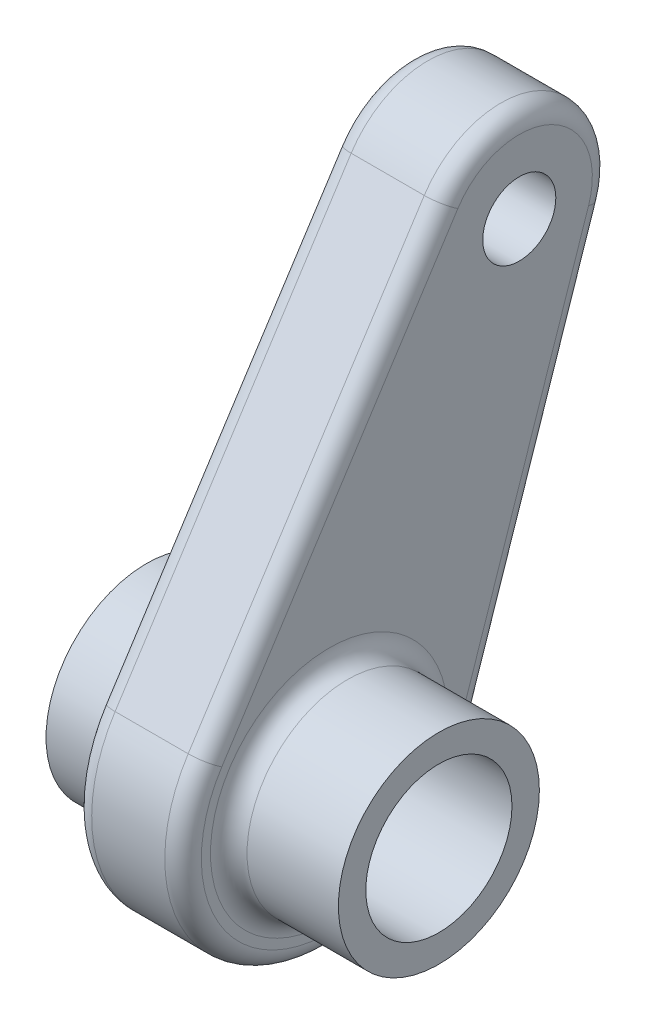
ISO-10303-21;
HEADER;
FILE_DESCRIPTION(('STEP AP214'),'2;1');
FILE_NAME('part.step','',(''),(''),'','','');
FILE_SCHEMA(('AUTOMOTIVE_DESIGN { 1 0 10303 214 1 1 1 1 }'));
ENDSEC;
DATA;
#1=APPLICATION_CONTEXT('core data for automotive mechanical design processes');
#2=APPLICATION_PROTOCOL_DEFINITION('international standard','automotive_design',2000,#1);
#3=PRODUCT_CONTEXT('',#1,'mechanical');
#4=PRODUCT('Part','Part','',(#3));
#5=PRODUCT_RELATED_PRODUCT_CATEGORY('part','',(#4));
#6=PRODUCT_DEFINITION_FORMATION('','',#4);
#7=PRODUCT_DEFINITION_CONTEXT('part definition',#1,'design');
#8=PRODUCT_DEFINITION('design','',#6,#7);
#9=PRODUCT_DEFINITION_SHAPE('','',#8);
#10=(LENGTH_UNIT() NAMED_UNIT(*) SI_UNIT(.MILLI.,.METRE.));
#11=(NAMED_UNIT(*) PLANE_ANGLE_UNIT() SI_UNIT($,.RADIAN.));
#12=(NAMED_UNIT(*) SI_UNIT($,.STERADIAN.) SOLID_ANGLE_UNIT());
#13=UNCERTAINTY_MEASURE_WITH_UNIT(LENGTH_MEASURE(1.E-05),#10,'distance_accuracy_value','');
#14=(GEOMETRIC_REPRESENTATION_CONTEXT(3) GLOBAL_UNCERTAINTY_ASSIGNED_CONTEXT((#13)) GLOBAL_UNIT_ASSIGNED_CONTEXT((#10,
#11,#12)) REPRESENTATION_CONTEXT('',''));
#15=CARTESIAN_POINT('',(0.,0.,0.));
#16=DIRECTION('',(0.,0.,1.));
#17=DIRECTION('',(1.,0.,0.));
#18=AXIS2_PLACEMENT_3D('',#15,#16,#17);
#19=CARTESIAN_POINT('',(19.05,0.,0.));
#20=DIRECTION('',(1.,0.,0.));
#21=DIRECTION('',(0.,0.,-1.));
#22=AXIS2_PLACEMENT_3D('',#19,#20,#21);
#23=PLANE('',#22);
#24=CARTESIAN_POINT('',(19.05,0.,0.));
#25=DIRECTION('',(1.,0.,0.));
#26=DIRECTION('',(0.,0.,-1.));
#27=AXIS2_PLACEMENT_3D('',#24,#25,#26);
#28=CIRCLE('',#27,20.6375);
#29=CARTESIAN_POINT('',(19.05,0.,-20.6375));
#30=VERTEX_POINT('',#29);
#31=EDGE_CURVE('E185',#30,#30,#28,.F.);
#32=ORIENTED_EDGE('',*,*,#31,.T.);
#33=EDGE_LOOP('',(#32));
#34=FACE_BOUND('',#33,.T.);
#35=CARTESIAN_POINT('',(19.05,68.675701226411,-33.0164816578135));
#36=DIRECTION('',(1.,0.,0.));
#37=DIRECTION('',(0.,0.,-1.));
#38=AXIS2_PLACEMENT_3D('',#35,#36,#37);
#39=CIRCLE('',#38,12.6999999999999);
#40=CARTESIAN_POINT('',(19.05,64.646857524905,-45.0605016855631));
#41=VERTEX_POINT('',#40);
#42=CARTESIAN_POINT('',(19.05,75.5660324790174,-22.3481483658061));
#43=VERTEX_POINT('',#42);
#44=EDGE_CURVE('E61',#41,#43,#39,.T.);
#45=ORIENTED_EDGE('',*,*,#44,.T.);
#46=DIRECTION('',(0.,0.840026243465153,-0.54254576792177));
#47=VECTOR('',#46,1.);
#48=CARTESIAN_POINT('',(19.05,12.0580796920614,18.669583261013));
#49=LINE('',#48,#47);
#50=CARTESIAN_POINT('',(19.05,12.0580796920613,18.669583261013));
#51=VERTEX_POINT('',#50);
#52=EDGE_CURVE('E182',#43,#51,#49,.F.);
#53=ORIENTED_EDGE('',*,*,#52,.T.);
#54=CARTESIAN_POINT('',(19.05,0.,0.));
#55=DIRECTION('',(1.,0.,0.));
#56=DIRECTION('',(0.,0.,-1.));
#57=AXIS2_PLACEMENT_3D('',#54,#55,#56);
#58=CIRCLE('',#57,22.225);
#59=CARTESIAN_POINT('',(19.05,-7.05047647763552,-21.0770350485619));
#60=VERTEX_POINT('',#59);
#61=EDGE_CURVE('E175',#51,#60,#58,.T.);
#62=ORIENTED_EDGE('',*,*,#61,.T.);
#63=DIRECTION('',(0.,-0.948348033681077,0.317231787520159));
#64=VECTOR('',#63,1.);
#65=CARTESIAN_POINT('',(19.05,-7.05047647763551,-21.0770350485619));
#66=LINE('',#65,#64);
#67=EDGE_CURVE('E66',#60,#41,#66,.F.);
#68=ORIENTED_EDGE('',*,*,#67,.T.);
#69=EDGE_LOOP('',(#45,#53,#62,#68));
#70=FACE_BOUND('',#69,.T.);
#71=CARTESIAN_POINT('',(19.05,68.675701226411,-33.0164816578135));
#72=DIRECTION('',(1.,0.,0.));
#73=DIRECTION('',(0.,0.,-1.));
#74=AXIS2_PLACEMENT_3D('',#71,#72,#73);
#75=CIRCLE('',#74,6.34999999999995);
#76=CARTESIAN_POINT('',(19.05,68.675701226411,-39.3664816578134));
#77=VERTEX_POINT('',#76);
#78=EDGE_CURVE('E239',#77,#77,#75,.T.);
#79=ORIENTED_EDGE('',*,*,#78,.F.);
#80=EDGE_LOOP('',(#79));
#81=FACE_BOUND('',#80,.T.);
#82=ADVANCED_FACE('F43',(#34,#70,#81),#23,.T.);
#83=CARTESIAN_POINT('',(-12.7,0.,0.));
#84=DIRECTION('',(1.,0.,0.));
#85=DIRECTION('',(0.,0.,-1.));
#86=AXIS2_PLACEMENT_3D('',#83,#84,#85);
#87=CYLINDRICAL_SURFACE('',#86,17.4625);
#88=CARTESIAN_POINT('',(-3.175,0.,0.));
#89=DIRECTION('',(1.,0.,0.));
#90=DIRECTION('',(0.,0.,-1.));
#91=AXIS2_PLACEMENT_3D('',#88,#89,#90);
#92=CIRCLE('',#91,17.4625);
#93=CARTESIAN_POINT('',(-3.175,0.,-17.4625));
#94=VERTEX_POINT('',#93);
#95=EDGE_CURVE('E193',#94,#94,#92,.F.);
#96=ORIENTED_EDGE('',*,*,#95,.T.);
#97=EDGE_LOOP('',(#96));
#98=FACE_BOUND('',#97,.T.);
#99=CARTESIAN_POINT('',(-12.7,0.,0.));
#100=DIRECTION('',(1.,0.,0.));
#101=DIRECTION('',(0.,0.,-1.));
#102=AXIS2_PLACEMENT_3D('',#99,#100,#101);
#103=CIRCLE('',#102,17.4625);
#104=CARTESIAN_POINT('',(-12.7,0.,-17.4625));
#105=VERTEX_POINT('',#104);
#106=EDGE_CURVE('E143',#105,#105,#103,.T.);
#107=ORIENTED_EDGE('',*,*,#106,.T.);
#108=EDGE_LOOP('',(#107));
#109=FACE_BOUND('',#108,.T.);
#110=ADVANCED_FACE('F234',(#98,#109),#87,.T.);
#111=CARTESIAN_POINT('',(-12.7,0.,0.));
#112=DIRECTION('',(1.,0.,0.));
#113=DIRECTION('',(0.,0.,-1.));
#114=AXIS2_PLACEMENT_3D('',#111,#112,#113);
#115=CYLINDRICAL_SURFACE('',#114,12.7);
#116=CARTESIAN_POINT('',(38.1,0.,0.));
#117=DIRECTION('',(1.,0.,0.));
#118=DIRECTION('',(0.,0.,-1.));
#119=AXIS2_PLACEMENT_3D('',#116,#117,#118);
#120=CIRCLE('',#119,12.7);
#121=CARTESIAN_POINT('',(38.1,0.,-12.7));
#122=VERTEX_POINT('',#121);
#123=EDGE_CURVE('E251',#122,#122,#120,.T.);
#124=ORIENTED_EDGE('',*,*,#123,.T.);
#125=EDGE_LOOP('',(#124));
#126=FACE_BOUND('',#125,.T.);
#127=CARTESIAN_POINT('',(-12.7,0.,0.));
#128=DIRECTION('',(1.,0.,0.));
#129=DIRECTION('',(0.,0.,-1.));
#130=AXIS2_PLACEMENT_3D('',#127,#128,#129);
#131=CIRCLE('',#130,12.7);
#132=CARTESIAN_POINT('',(-12.7,0.,-12.7));
#133=VERTEX_POINT('',#132);
#134=EDGE_CURVE('E139',#133,#133,#131,.T.);
#135=ORIENTED_EDGE('',*,*,#134,.F.);
#136=EDGE_LOOP('',(#135));
#137=FACE_BOUND('',#136,.T.);
#138=ADVANCED_FACE('F275',(#126,#137),#115,.F.);
#139=CARTESIAN_POINT('',(-12.7,0.,0.));
#140=DIRECTION('',(1.,0.,0.));
#141=DIRECTION('',(0.,0.,-1.));
#142=AXIS2_PLACEMENT_3D('',#139,#140,#141);
#143=PLANE('',#142);
#144=ORIENTED_EDGE('',*,*,#106,.F.);
#145=EDGE_LOOP('',(#144));
#146=FACE_BOUND('',#145,.T.);
#147=ORIENTED_EDGE('',*,*,#134,.T.);
#148=EDGE_LOOP('',(#147));
#149=FACE_BOUND('',#148,.T.);
#150=ADVANCED_FACE('F271',(#146,#149),#143,.F.);
#151=CARTESIAN_POINT('',(19.05,-8.05768740301202,-24.0880400554993));
#152=DIRECTION('',(0.,-0.317231787520159,-0.948348033681077));
#153=DIRECTION('',(0.,0.948348033681077,-0.317231787520159));
#154=AXIS2_PLACEMENT_3D('',#151,#152,#153);
#155=PLANE('',#154);
#156=DIRECTION('',(-1.,0.,0.));
#157=VECTOR('',#156,1.);
#158=CARTESIAN_POINT('',(19.05,-8.05768740301201,-24.0880400554993));
#159=LINE('',#158,#157);
#160=CARTESIAN_POINT('',(15.875,-8.05768740301201,-24.0880400554993));
#161=VERTEX_POINT('',#160);
#162=CARTESIAN_POINT('',(3.17500000000001,-8.05768740301201,-24.0880400554993));
#163=VERTEX_POINT('',#162);
#164=EDGE_CURVE('E242',#161,#163,#159,.T.);
#165=ORIENTED_EDGE('',*,*,#164,.T.);
#166=DIRECTION('',(0.,-0.948348033681077,0.317231787520159));
#167=VECTOR('',#166,1.);
#168=CARTESIAN_POINT('',(3.175,63.6396465995285,-48.0715066925005));
#169=LINE('',#168,#167);
#170=CARTESIAN_POINT('',(3.17500000000001,63.6396465995285,-48.0715066925005));
#171=VERTEX_POINT('',#170);
#172=EDGE_CURVE('E128',#163,#171,#169,.F.);
#173=ORIENTED_EDGE('',*,*,#172,.T.);
#174=DIRECTION('',(-1.,0.,0.));
#175=VECTOR('',#174,1.);
#176=CARTESIAN_POINT('',(19.05,63.6396465995285,-48.0715066925005));
#177=LINE('',#176,#175);
#178=CARTESIAN_POINT('',(15.875,63.6396465995285,-48.0715066925005));
#179=VERTEX_POINT('',#178);
#180=EDGE_CURVE('E263',#179,#171,#177,.T.);
#181=ORIENTED_EDGE('',*,*,#180,.F.);
#182=DIRECTION('',(0.,-0.948348033681077,0.317231787520159));
#183=VECTOR('',#182,1.);
#184=CARTESIAN_POINT('',(15.875,-8.05768740301202,-24.0880400554993));
#185=LINE('',#184,#183);
#186=EDGE_CURVE('E170',#179,#161,#185,.T.);
#187=ORIENTED_EDGE('',*,*,#186,.T.);
#188=EDGE_LOOP('',(#165,#173,#181,#187));
#189=FACE_BOUND('',#188,.T.);
#190=ADVANCED_FACE('F274',(#189),#155,.T.);
#191=CARTESIAN_POINT('',(19.05,68.675701226411,-33.0164816578135));
#192=DIRECTION('',(-1.,0.,0.));
#193=DIRECTION('',(0.,0.,1.));
#194=AXIS2_PLACEMENT_3D('',#191,#192,#193);
#195=CYLINDRICAL_SURFACE('',#194,15.8749999999999);
#196=ORIENTED_EDGE('',*,*,#180,.T.);
#197=CARTESIAN_POINT('',(3.175,68.675701226411,-33.0164816578135));
#198=DIRECTION('',(1.,0.,0.));
#199=DIRECTION('',(0.,0.,-1.));
#200=AXIS2_PLACEMENT_3D('',#197,#198,#199);
#201=CIRCLE('',#200,15.8749999999999);
#202=CARTESIAN_POINT('',(3.17500000000001,77.2886152921691,-19.6810650428042));
#203=VERTEX_POINT('',#202);
#204=EDGE_CURVE('E167',#171,#203,#201,.T.);
#205=ORIENTED_EDGE('',*,*,#204,.T.);
#206=DIRECTION('',(-1.,0.,0.));
#207=VECTOR('',#206,1.);
#208=CARTESIAN_POINT('',(19.05,77.2886152921691,-19.6810650428042));
#209=LINE('',#208,#207);
#210=CARTESIAN_POINT('',(15.875,77.2886152921691,-19.6810650428042));
#211=VERTEX_POINT('',#210);
#212=EDGE_CURVE('E259',#211,#203,#209,.T.);
#213=ORIENTED_EDGE('',*,*,#212,.F.);
#214=CARTESIAN_POINT('',(15.875,68.675701226411,-33.0164816578135));
#215=DIRECTION('',(1.,0.,0.));
#216=DIRECTION('',(0.,0.,-1.));
#217=AXIS2_PLACEMENT_3D('',#214,#215,#216);
#218=CIRCLE('',#217,15.8749999999999);
#219=EDGE_CURVE('E164',#211,#179,#218,.F.);
#220=ORIENTED_EDGE('',*,*,#219,.T.);
#221=EDGE_LOOP('',(#196,#205,#213,#220));
#222=FACE_BOUND('',#221,.T.);
#223=ADVANCED_FACE('F350',(#222),#195,.T.);
#224=CARTESIAN_POINT('',(19.05,13.780662505213,21.3366665840149));
#225=DIRECTION('',(0.,0.54254576792177,0.840026243465153));
#226=DIRECTION('',(0.,-0.840026243465153,0.54254576792177));
#227=AXIS2_PLACEMENT_3D('',#224,#225,#226);
#228=PLANE('',#227);
#229=ORIENTED_EDGE('',*,*,#212,.T.);
#230=DIRECTION('',(0.,0.840026243465153,-0.54254576792177));
#231=VECTOR('',#230,1.);
#232=CARTESIAN_POINT('',(3.175,13.780662505213,21.3366665840149));
#233=LINE('',#232,#231);
#234=CARTESIAN_POINT('',(3.17500000000001,13.780662505213,21.3366665840149));
#235=VERTEX_POINT('',#234);
#236=EDGE_CURVE('E160',#203,#235,#233,.F.);
#237=ORIENTED_EDGE('',*,*,#236,.T.);
#238=DIRECTION('',(-1.,0.,0.));
#239=VECTOR('',#238,1.);
#240=CARTESIAN_POINT('',(19.05,13.780662505213,21.3366665840149));
#241=LINE('',#240,#239);
#242=CARTESIAN_POINT('',(15.875,13.780662505213,21.3366665840149));
#243=VERTEX_POINT('',#242);
#244=EDGE_CURVE('E248',#243,#235,#241,.T.);
#245=ORIENTED_EDGE('',*,*,#244,.F.);
#246=DIRECTION('',(0.,0.840026243465153,-0.54254576792177));
#247=VECTOR('',#246,1.);
#248=CARTESIAN_POINT('',(15.875,13.780662505213,21.3366665840149));
#249=LINE('',#248,#247);
#250=EDGE_CURVE('E156',#243,#211,#249,.T.);
#251=ORIENTED_EDGE('',*,*,#250,.T.);
#252=EDGE_LOOP('',(#229,#237,#245,#251));
#253=FACE_BOUND('',#252,.T.);
#254=ADVANCED_FACE('F344',(#253),#228,.T.);
#255=CARTESIAN_POINT('',(19.05,68.675701226411,-33.0164816578135));
#256=DIRECTION('',(-1.,0.,0.));
#257=DIRECTION('',(0.,0.,1.));
#258=AXIS2_PLACEMENT_3D('',#255,#256,#257);
#259=CYLINDRICAL_SURFACE('',#258,6.34999999999995);
#260=ORIENTED_EDGE('',*,*,#78,.T.);
#261=EDGE_LOOP('',(#260));
#262=FACE_BOUND('',#261,.T.);
#263=CARTESIAN_POINT('',(0.,68.675701226411,-33.0164816578135));
#264=DIRECTION('',(1.,0.,0.));
#265=DIRECTION('',(0.,0.,-1.));
#266=AXIS2_PLACEMENT_3D('',#263,#264,#265);
#267=CIRCLE('',#266,6.34999999999995);
#268=CARTESIAN_POINT('',(0.,68.675701226411,-39.3664816578134));
#269=VERTEX_POINT('',#268);
#270=EDGE_CURVE('E243',#269,#269,#267,.T.);
#271=ORIENTED_EDGE('',*,*,#270,.F.);
#272=EDGE_LOOP('',(#271));
#273=FACE_BOUND('',#272,.T.);
#274=ADVANCED_FACE('F341',(#262,#273),#259,.F.);
#275=CARTESIAN_POINT('',(19.05,0.,0.));
#276=DIRECTION('',(-1.,0.,0.));
#277=DIRECTION('',(0.,0.,1.));
#278=AXIS2_PLACEMENT_3D('',#275,#276,#277);
#279=CYLINDRICAL_SURFACE('',#278,25.4);
#280=ORIENTED_EDGE('',*,*,#244,.T.);
#281=CARTESIAN_POINT('',(3.175,0.,0.));
#282=DIRECTION('',(1.,0.,0.));
#283=DIRECTION('',(0.,0.,-1.));
#284=AXIS2_PLACEMENT_3D('',#281,#282,#283);
#285=CIRCLE('',#284,25.4);
#286=EDGE_CURVE('E11',#235,#163,#285,.T.);
#287=ORIENTED_EDGE('',*,*,#286,.T.);
#288=ORIENTED_EDGE('',*,*,#164,.F.);
#289=CARTESIAN_POINT('',(15.875,0.,0.));
#290=DIRECTION('',(1.,0.,0.));
#291=DIRECTION('',(0.,0.,-1.));
#292=AXIS2_PLACEMENT_3D('',#289,#290,#291);
#293=CIRCLE('',#292,25.4);
#294=EDGE_CURVE('E53',#161,#243,#293,.F.);
#295=ORIENTED_EDGE('',*,*,#294,.T.);
#296=EDGE_LOOP('',(#280,#287,#288,#295));
#297=FACE_BOUND('',#296,.T.);
#298=ADVANCED_FACE('F339',(#297),#279,.T.);
#299=CARTESIAN_POINT('',(0.,0.,0.));
#300=DIRECTION('',(1.,0.,0.));
#301=DIRECTION('',(0.,0.,-1.));
#302=AXIS2_PLACEMENT_3D('',#299,#300,#301);
#303=PLANE('',#302);
#304=CARTESIAN_POINT('',(0.,0.,0.));
#305=DIRECTION('',(1.,0.,0.));
#306=DIRECTION('',(0.,0.,-1.));
#307=AXIS2_PLACEMENT_3D('',#304,#305,#306);
#308=CIRCLE('',#307,20.6375);
#309=CARTESIAN_POINT('',(0.,0.,-20.6375));
#310=VERTEX_POINT('',#309);
#311=EDGE_CURVE('E152',#310,#310,#308,.T.);
#312=ORIENTED_EDGE('',*,*,#311,.T.);
#313=EDGE_LOOP('',(#312));
#314=FACE_BOUND('',#313,.T.);
#315=CARTESIAN_POINT('',(0.,0.,0.));
#316=DIRECTION('',(1.,0.,0.));
#317=DIRECTION('',(0.,0.,-1.));
#318=AXIS2_PLACEMENT_3D('',#315,#316,#317);
#319=CIRCLE('',#318,22.225);
#320=CARTESIAN_POINT('',(0.,-7.05047647763552,-21.0770350485619));
#321=VERTEX_POINT('',#320);
#322=CARTESIAN_POINT('',(0.,12.0580796920613,18.669583261013));
#323=VERTEX_POINT('',#322);
#324=EDGE_CURVE('E115',#321,#323,#319,.F.);
#325=ORIENTED_EDGE('',*,*,#324,.T.);
#326=DIRECTION('',(0.,0.840026243465153,-0.54254576792177));
#327=VECTOR('',#326,1.);
#328=CARTESIAN_POINT('',(0.,75.5660324790175,-22.348148365806));
#329=LINE('',#328,#327);
#330=CARTESIAN_POINT('',(0.,75.5660324790174,-22.3481483658061));
#331=VERTEX_POINT('',#330);
#332=EDGE_CURVE('E149',#323,#331,#329,.T.);
#333=ORIENTED_EDGE('',*,*,#332,.T.);
#334=CARTESIAN_POINT('',(0.,68.675701226411,-33.0164816578135));
#335=DIRECTION('',(1.,0.,0.));
#336=DIRECTION('',(0.,0.,-1.));
#337=AXIS2_PLACEMENT_3D('',#334,#335,#336);
#338=CIRCLE('',#337,12.6999999999999);
#339=CARTESIAN_POINT('',(0.,64.646857524905,-45.0605016855631));
#340=VERTEX_POINT('',#339);
#341=EDGE_CURVE('E118',#331,#340,#338,.F.);
#342=ORIENTED_EDGE('',*,*,#341,.T.);
#343=DIRECTION('',(0.,-0.948348033681077,0.317231787520159));
#344=VECTOR('',#343,1.);
#345=CARTESIAN_POINT('',(0.,-7.05047647763551,-21.0770350485619));
#346=LINE('',#345,#344);
#347=EDGE_CURVE('E109',#340,#321,#346,.T.);
#348=ORIENTED_EDGE('',*,*,#347,.T.);
#349=EDGE_LOOP('',(#325,#333,#342,#348));
#350=FACE_BOUND('',#349,.T.);
#351=ORIENTED_EDGE('',*,*,#270,.T.);
#352=EDGE_LOOP('',(#351));
#353=FACE_BOUND('',#352,.T.);
#354=ADVANCED_FACE('F111',(#314,#350,#353),#303,.F.);
#355=CARTESIAN_POINT('',(38.1,0.,0.));
#356=DIRECTION('',(-1.,0.,0.));
#357=DIRECTION('',(0.,0.,1.));
#358=AXIS2_PLACEMENT_3D('',#355,#356,#357);
#359=CYLINDRICAL_SURFACE('',#358,17.4625);
#360=CARTESIAN_POINT('',(22.225,0.,0.));
#361=DIRECTION('',(1.,0.,0.));
#362=DIRECTION('',(0.,0.,-1.));
#363=AXIS2_PLACEMENT_3D('',#360,#361,#362);
#364=CIRCLE('',#363,17.4625);
#365=CARTESIAN_POINT('',(22.225,0.,-17.4625));
#366=VERTEX_POINT('',#365);
#367=EDGE_CURVE('E189',#366,#366,#364,.T.);
#368=ORIENTED_EDGE('',*,*,#367,.T.);
#369=EDGE_LOOP('',(#368));
#370=FACE_BOUND('',#369,.T.);
#371=CARTESIAN_POINT('',(38.1,0.,0.));
#372=DIRECTION('',(1.,0.,0.));
#373=DIRECTION('',(0.,0.,-1.));
#374=AXIS2_PLACEMENT_3D('',#371,#372,#373);
#375=CIRCLE('',#374,17.4625);
#376=CARTESIAN_POINT('',(38.1,0.,-17.4625));
#377=VERTEX_POINT('',#376);
#378=EDGE_CURVE('E132',#377,#377,#375,.T.);
#379=ORIENTED_EDGE('',*,*,#378,.F.);
#380=EDGE_LOOP('',(#379));
#381=FACE_BOUND('',#380,.T.);
#382=ADVANCED_FACE('F321',(#370,#381),#359,.T.);
#383=CARTESIAN_POINT('',(38.1,0.,0.));
#384=DIRECTION('',(1.,0.,0.));
#385=DIRECTION('',(0.,0.,-1.));
#386=AXIS2_PLACEMENT_3D('',#383,#384,#385);
#387=PLANE('',#386);
#388=ORIENTED_EDGE('',*,*,#378,.T.);
#389=EDGE_LOOP('',(#388));
#390=FACE_BOUND('',#389,.T.);
#391=ORIENTED_EDGE('',*,*,#123,.F.);
#392=EDGE_LOOP('',(#391));
#393=FACE_BOUND('',#392,.T.);
#394=ADVANCED_FACE('F302',(#390,#393),#387,.T.);
#395=CARTESIAN_POINT('',(3.175,-7.05047647763551,-21.0770350485619));
#396=DIRECTION('',(0.,0.948348033681077,-0.317231787520159));
#397=DIRECTION('',(0.,0.317231787520159,0.948348033681077));
#398=AXIS2_PLACEMENT_3D('',#395,#396,#397);
#399=CYLINDRICAL_SURFACE('',#398,3.175);
#400=CARTESIAN_POINT('',(3.175,64.646857524905,-45.0605016855631));
#401=DIRECTION('',(0.,0.948348033681077,-0.317231787520159));
#402=DIRECTION('',(0.,0.317231787520159,0.948348033681077));
#403=AXIS2_PLACEMENT_3D('',#400,#401,#402);
#404=CIRCLE('',#403,3.175);
#405=EDGE_CURVE('E133',#171,#340,#404,.T.);
#406=ORIENTED_EDGE('',*,*,#405,.F.);
#407=ORIENTED_EDGE('',*,*,#172,.F.);
#408=CARTESIAN_POINT('',(3.175,-7.05047647763551,-21.0770350485619));
#409=DIRECTION('',(0.,-0.948348033681077,0.317231787520159));
#410=DIRECTION('',(0.,-0.317231787520159,-0.948348033681077));
#411=AXIS2_PLACEMENT_3D('',#408,#409,#410);
#412=CIRCLE('',#411,3.175);
#413=EDGE_CURVE('E126',#321,#163,#412,.T.);
#414=ORIENTED_EDGE('',*,*,#413,.F.);
#415=ORIENTED_EDGE('',*,*,#347,.F.);
#416=EDGE_LOOP('',(#406,#407,#414,#415));
#417=FACE_BOUND('',#416,.T.);
#418=ADVANCED_FACE('F127',(#417),#399,.T.);
#419=CARTESIAN_POINT('',(3.175,0.,0.));
#420=DIRECTION('',(1.,0.,0.));
#421=DIRECTION('',(0.,0.,-1.));
#422=AXIS2_PLACEMENT_3D('',#419,#420,#421);
#423=TOROIDAL_SURFACE('',#422,22.225,3.175);
#424=ORIENTED_EDGE('',*,*,#413,.T.);
#425=ORIENTED_EDGE('',*,*,#286,.F.);
#426=CARTESIAN_POINT('',(3.175,12.0580796920613,18.669583261013));
#427=DIRECTION('',(0.,0.840026243465153,-0.54254576792177));
#428=DIRECTION('',(0.,0.54254576792177,0.840026243465153));
#429=AXIS2_PLACEMENT_3D('',#426,#427,#428);
#430=CIRCLE('',#429,3.175);
#431=EDGE_CURVE('E136',#323,#235,#430,.T.);
#432=ORIENTED_EDGE('',*,*,#431,.F.);
#433=ORIENTED_EDGE('',*,*,#324,.F.);
#434=EDGE_LOOP('',(#424,#425,#432,#433));
#435=FACE_BOUND('',#434,.T.);
#436=ADVANCED_FACE('F135',(#435),#423,.T.);
#437=CARTESIAN_POINT('',(3.175,68.675701226411,-33.0164816578135));
#438=DIRECTION('',(1.,0.,0.));
#439=DIRECTION('',(0.,0.,-1.));
#440=AXIS2_PLACEMENT_3D('',#437,#438,#439);
#441=TOROIDAL_SURFACE('',#440,12.6999999999999,3.175);
#442=ORIENTED_EDGE('',*,*,#405,.T.);
#443=ORIENTED_EDGE('',*,*,#341,.F.);
#444=CARTESIAN_POINT('',(3.175,75.5660324790174,-22.3481483658061));
#445=DIRECTION('',(0.,-0.840026243465154,0.542545767921769));
#446=DIRECTION('',(0.,-0.542545767921769,-0.840026243465154));
#447=AXIS2_PLACEMENT_3D('',#444,#445,#446);
#448=CIRCLE('',#447,3.175);
#449=EDGE_CURVE('E199',#203,#331,#448,.T.);
#450=ORIENTED_EDGE('',*,*,#449,.F.);
#451=ORIENTED_EDGE('',*,*,#204,.F.);
#452=EDGE_LOOP('',(#442,#443,#450,#451));
#453=FACE_BOUND('',#452,.T.);
#454=ADVANCED_FACE('F293',(#453),#441,.T.);
#455=CARTESIAN_POINT('',(3.175,12.0580796920614,18.669583261013));
#456=DIRECTION('',(0.,-0.840026243465153,0.54254576792177));
#457=DIRECTION('',(0.,-0.54254576792177,-0.840026243465153));
#458=AXIS2_PLACEMENT_3D('',#455,#456,#457);
#459=CYLINDRICAL_SURFACE('',#458,3.175);
#460=ORIENTED_EDGE('',*,*,#431,.T.);
#461=ORIENTED_EDGE('',*,*,#236,.F.);
#462=ORIENTED_EDGE('',*,*,#449,.T.);
#463=ORIENTED_EDGE('',*,*,#332,.F.);
#464=EDGE_LOOP('',(#460,#461,#462,#463));
#465=FACE_BOUND('',#464,.T.);
#466=ADVANCED_FACE('F290',(#465),#459,.T.);
#467=CARTESIAN_POINT('',(15.875,-7.05047647763551,-21.0770350485619));
#468=DIRECTION('',(0.,-0.948348033681077,0.317231787520159));
#469=DIRECTION('',(0.,-0.317231787520159,-0.948348033681077));
#470=AXIS2_PLACEMENT_3D('',#467,#468,#469);
#471=CYLINDRICAL_SURFACE('',#470,3.175);
#472=CARTESIAN_POINT('',(15.875,64.646857524905,-45.0605016855631));
#473=DIRECTION('',(0.,0.948348033681076,-0.31723178752016));
#474=DIRECTION('',(0.,0.31723178752016,0.948348033681076));
#475=AXIS2_PLACEMENT_3D('',#472,#473,#474);
#476=CIRCLE('',#475,3.175);
#477=EDGE_CURVE('E211',#41,#179,#476,.T.);
#478=ORIENTED_EDGE('',*,*,#477,.F.);
#479=ORIENTED_EDGE('',*,*,#67,.F.);
#480=CARTESIAN_POINT('',(15.875,-7.05047647763551,-21.0770350485619));
#481=DIRECTION('',(0.,-0.948348033681077,0.317231787520158));
#482=DIRECTION('',(0.,-0.317231787520158,-0.948348033681077));
#483=AXIS2_PLACEMENT_3D('',#480,#481,#482);
#484=CIRCLE('',#483,3.175);
#485=EDGE_CURVE('E47',#161,#60,#484,.T.);
#486=ORIENTED_EDGE('',*,*,#485,.F.);
#487=ORIENTED_EDGE('',*,*,#186,.F.);
#488=EDGE_LOOP('',(#478,#479,#486,#487));
#489=FACE_BOUND('',#488,.T.);
#490=ADVANCED_FACE('F226',(#489),#471,.T.);
#491=CARTESIAN_POINT('',(15.875,0.,0.));
#492=DIRECTION('',(1.,0.,0.));
#493=DIRECTION('',(0.,0.,-1.));
#494=AXIS2_PLACEMENT_3D('',#491,#492,#493);
#495=TOROIDAL_SURFACE('',#494,22.225,3.175);
#496=ORIENTED_EDGE('',*,*,#485,.T.);
#497=ORIENTED_EDGE('',*,*,#61,.F.);
#498=CARTESIAN_POINT('',(15.875,12.0580796920613,18.669583261013));
#499=DIRECTION('',(0.,0.840026243465153,-0.54254576792177));
#500=DIRECTION('',(0.,0.54254576792177,0.840026243465153));
#501=AXIS2_PLACEMENT_3D('',#498,#499,#500);
#502=CIRCLE('',#501,3.175);
#503=EDGE_CURVE('E209',#243,#51,#502,.T.);
#504=ORIENTED_EDGE('',*,*,#503,.F.);
#505=ORIENTED_EDGE('',*,*,#294,.F.);
#506=EDGE_LOOP('',(#496,#497,#504,#505));
#507=FACE_BOUND('',#506,.T.);
#508=ADVANCED_FACE('F222',(#507),#495,.T.);
#509=CARTESIAN_POINT('',(15.875,68.675701226411,-33.0164816578135));
#510=DIRECTION('',(1.,0.,0.));
#511=DIRECTION('',(0.,0.,-1.));
#512=AXIS2_PLACEMENT_3D('',#509,#510,#511);
#513=TOROIDAL_SURFACE('',#512,12.6999999999999,3.175);
#514=ORIENTED_EDGE('',*,*,#477,.T.);
#515=ORIENTED_EDGE('',*,*,#219,.F.);
#516=CARTESIAN_POINT('',(15.875,75.5660324790174,-22.3481483658061));
#517=DIRECTION('',(0.,-0.840026243465154,0.542545767921769));
#518=DIRECTION('',(0.,-0.542545767921769,-0.840026243465154));
#519=AXIS2_PLACEMENT_3D('',#516,#517,#518);
#520=CIRCLE('',#519,3.175);
#521=EDGE_CURVE('E206',#43,#211,#520,.T.);
#522=ORIENTED_EDGE('',*,*,#521,.F.);
#523=ORIENTED_EDGE('',*,*,#44,.F.);
#524=EDGE_LOOP('',(#514,#515,#522,#523));
#525=FACE_BOUND('',#524,.T.);
#526=ADVANCED_FACE('F228',(#525),#513,.T.);
#527=CARTESIAN_POINT('',(15.875,12.0580796920614,18.669583261013));
#528=DIRECTION('',(0.,0.840026243465153,-0.54254576792177));
#529=DIRECTION('',(0.,0.54254576792177,0.840026243465153));
#530=AXIS2_PLACEMENT_3D('',#527,#528,#529);
#531=CYLINDRICAL_SURFACE('',#530,3.175);
#532=ORIENTED_EDGE('',*,*,#503,.T.);
#533=ORIENTED_EDGE('',*,*,#52,.F.);
#534=ORIENTED_EDGE('',*,*,#521,.T.);
#535=ORIENTED_EDGE('',*,*,#250,.F.);
#536=EDGE_LOOP('',(#532,#533,#534,#535));
#537=FACE_BOUND('',#536,.T.);
#538=ADVANCED_FACE('F231',(#537),#531,.T.);
#539=CARTESIAN_POINT('',(22.225,0.,0.));
#540=DIRECTION('',(1.,0.,0.));
#541=DIRECTION('',(0.,0.,-1.));
#542=AXIS2_PLACEMENT_3D('',#539,#540,#541);
#543=TOROIDAL_SURFACE('',#542,20.6375,3.175);
#544=ORIENTED_EDGE('',*,*,#367,.F.);
#545=EDGE_LOOP('',(#544));
#546=FACE_BOUND('',#545,.T.);
#547=ORIENTED_EDGE('',*,*,#31,.F.);
#548=EDGE_LOOP('',(#547));
#549=FACE_BOUND('',#548,.T.);
#550=ADVANCED_FACE('F305',(#546,#549),#543,.F.);
#551=CARTESIAN_POINT('',(-3.175,0.,0.));
#552=DIRECTION('',(1.,0.,0.));
#553=DIRECTION('',(0.,0.,-1.));
#554=AXIS2_PLACEMENT_3D('',#551,#552,#553);
#555=TOROIDAL_SURFACE('',#554,20.6375,3.175);
#556=ORIENTED_EDGE('',*,*,#95,.F.);
#557=EDGE_LOOP('',(#556));
#558=FACE_BOUND('',#557,.T.);
#559=ORIENTED_EDGE('',*,*,#311,.F.);
#560=EDGE_LOOP('',(#559));
#561=FACE_BOUND('',#560,.T.);
#562=ADVANCED_FACE('F45',(#558,#561),#555,.F.);
#563=CLOSED_SHELL('',(#82,#110,#138,#150,#190,#223,#254,#274,#298,#354,#382,#394,#418,#436,#454,
#466,#490,#508,#526,#538,#550,#562));
#564=MANIFOLD_SOLID_BREP('B2',#563);
#565=ADVANCED_BREP_SHAPE_REPRESENTATION('',(#18,#564),#14);
#566=SHAPE_DEFINITION_REPRESENTATION(#9,#565);
ENDSEC;
END-ISO-10303-21;
